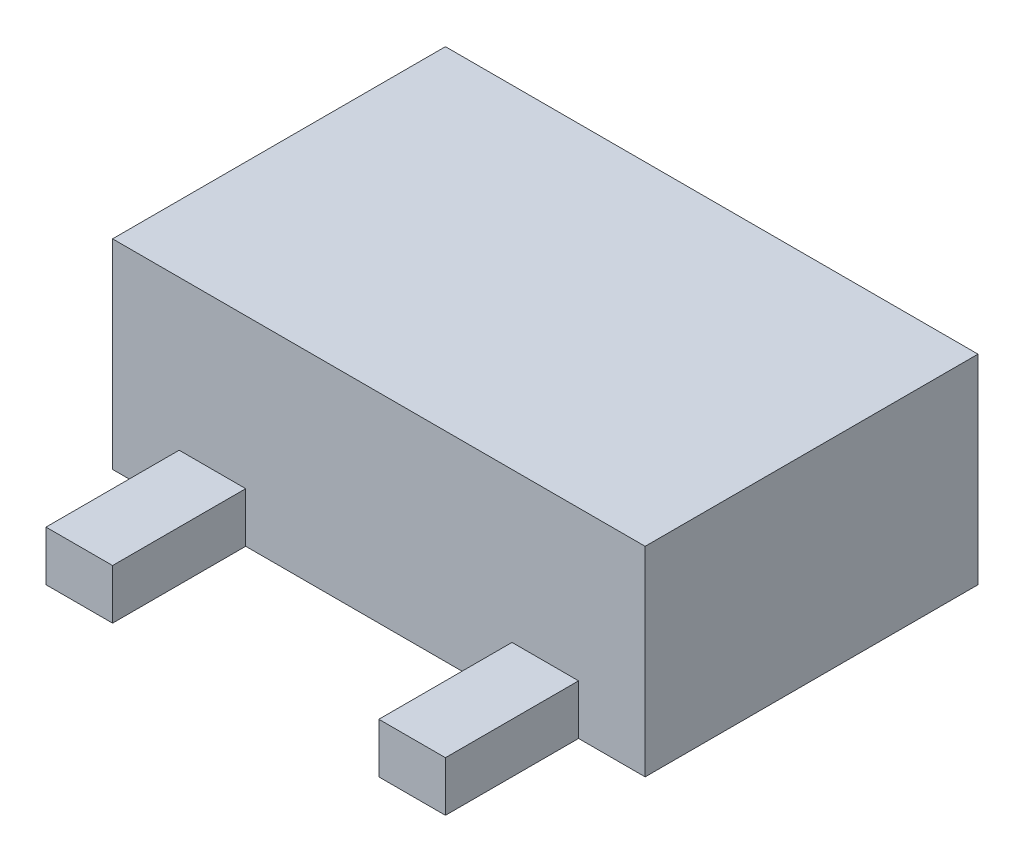
ISO-10303-21;
HEADER;
FILE_DESCRIPTION(('STEP AP214'),'2;1');
FILE_NAME('part.step','',(''),(''),'','','');
FILE_SCHEMA(('AUTOMOTIVE_DESIGN { 1 0 10303 214 1 1 1 1 }'));
ENDSEC;
DATA;
#1=APPLICATION_CONTEXT('core data for automotive mechanical design processes');
#2=APPLICATION_PROTOCOL_DEFINITION('international standard','automotive_design',2000,#1);
#3=PRODUCT_CONTEXT('',#1,'mechanical');
#4=PRODUCT('Part','Part','',(#3));
#5=PRODUCT_RELATED_PRODUCT_CATEGORY('part','',(#4));
#6=PRODUCT_DEFINITION_FORMATION('','',#4);
#7=PRODUCT_DEFINITION_CONTEXT('part definition',#1,'design');
#8=PRODUCT_DEFINITION('design','',#6,#7);
#9=PRODUCT_DEFINITION_SHAPE('','',#8);
#10=(LENGTH_UNIT() NAMED_UNIT(*) SI_UNIT(.MILLI.,.METRE.));
#11=(NAMED_UNIT(*) PLANE_ANGLE_UNIT() SI_UNIT($,.RADIAN.));
#12=(NAMED_UNIT(*) SI_UNIT($,.STERADIAN.) SOLID_ANGLE_UNIT());
#13=UNCERTAINTY_MEASURE_WITH_UNIT(LENGTH_MEASURE(1.E-05),#10,'distance_accuracy_value','');
#14=(GEOMETRIC_REPRESENTATION_CONTEXT(3) GLOBAL_UNCERTAINTY_ASSIGNED_CONTEXT((#13)) GLOBAL_UNIT_ASSIGNED_CONTEXT((#10,
#11,#12)) REPRESENTATION_CONTEXT('',''));
#15=CARTESIAN_POINT('',(0.,0.,0.));
#16=DIRECTION('',(0.,0.,1.));
#17=DIRECTION('',(1.,0.,0.));
#18=AXIS2_PLACEMENT_3D('',#15,#16,#17);
#19=CARTESIAN_POINT('',(-0.8,0.6,0.5));
#20=DIRECTION('',(0.,0.,-1.));
#21=DIRECTION('',(-1.,0.,0.));
#22=AXIS2_PLACEMENT_3D('',#19,#20,#21);
#23=PLANE('',#22);
#24=DIRECTION('',(-1.,0.,0.));
#25=VECTOR('',#24,1.);
#26=CARTESIAN_POINT('',(0.6,0.15,0.5));
#27=LINE('',#26,#25);
#28=CARTESIAN_POINT('',(0.6,0.15,0.5));
#29=VERTEX_POINT('',#28);
#30=CARTESIAN_POINT('',(0.4,0.15,0.5));
#31=VERTEX_POINT('',#30);
#32=EDGE_CURVE('E54',#29,#31,#27,.T.);
#33=ORIENTED_EDGE('',*,*,#32,.F.);
#34=DIRECTION('',(0.,-1.,0.));
#35=VECTOR('',#34,1.);
#36=CARTESIAN_POINT('',(0.6,0.597213595499958,0.5));
#37=LINE('',#36,#35);
#38=CARTESIAN_POINT('',(0.6,0.,0.5));
#39=VERTEX_POINT('',#38);
#40=EDGE_CURVE('E162',#29,#39,#37,.T.);
#41=ORIENTED_EDGE('',*,*,#40,.T.);
#42=DIRECTION('',(1.,0.,0.));
#43=VECTOR('',#42,1.);
#44=CARTESIAN_POINT('',(-0.8,0.,0.5));
#45=LINE('',#44,#43);
#46=CARTESIAN_POINT('',(0.8,0.,0.5));
#47=VERTEX_POINT('',#46);
#48=EDGE_CURVE('E147',#39,#47,#45,.T.);
#49=ORIENTED_EDGE('',*,*,#48,.T.);
#50=DIRECTION('',(0.,-1.,0.));
#51=VECTOR('',#50,1.);
#52=CARTESIAN_POINT('',(0.8,0.6,0.5));
#53=LINE('',#52,#51);
#54=CARTESIAN_POINT('',(0.8,0.6,0.5));
#55=VERTEX_POINT('',#54);
#56=EDGE_CURVE('E249',#55,#47,#53,.T.);
#57=ORIENTED_EDGE('',*,*,#56,.F.);
#58=DIRECTION('',(1.,0.,0.));
#59=VECTOR('',#58,1.);
#60=CARTESIAN_POINT('',(-0.8,0.6,0.5));
#61=LINE('',#60,#59);
#62=CARTESIAN_POINT('',(-0.8,0.6,0.5));
#63=VERTEX_POINT('',#62);
#64=EDGE_CURVE('E247',#63,#55,#61,.T.);
#65=ORIENTED_EDGE('',*,*,#64,.F.);
#66=DIRECTION('',(0.,-1.,0.));
#67=VECTOR('',#66,1.);
#68=CARTESIAN_POINT('',(-0.8,0.6,0.5));
#69=LINE('',#68,#67);
#70=CARTESIAN_POINT('',(-0.8,0.,0.5));
#71=VERTEX_POINT('',#70);
#72=EDGE_CURVE('E258',#63,#71,#69,.T.);
#73=ORIENTED_EDGE('',*,*,#72,.T.);
#74=CARTESIAN_POINT('',(-0.6,0.,0.5));
#75=VERTEX_POINT('',#74);
#76=EDGE_CURVE('E160',#71,#75,#45,.T.);
#77=ORIENTED_EDGE('',*,*,#76,.T.);
#78=DIRECTION('',(0.,-1.,0.));
#79=VECTOR('',#78,1.);
#80=CARTESIAN_POINT('',(-0.6,0.597213595499958,0.5));
#81=LINE('',#80,#79);
#82=CARTESIAN_POINT('',(-0.6,0.15,0.5));
#83=VERTEX_POINT('',#82);
#84=EDGE_CURVE('E205',#83,#75,#81,.T.);
#85=ORIENTED_EDGE('',*,*,#84,.F.);
#86=DIRECTION('',(1.,0.,0.));
#87=VECTOR('',#86,1.);
#88=CARTESIAN_POINT('',(-0.6,0.15,0.5));
#89=LINE('',#88,#87);
#90=CARTESIAN_POINT('',(-0.4,0.15,0.5));
#91=VERTEX_POINT('',#90);
#92=EDGE_CURVE('E191',#83,#91,#89,.T.);
#93=ORIENTED_EDGE('',*,*,#92,.T.);
#94=DIRECTION('',(0.,-1.,0.));
#95=VECTOR('',#94,1.);
#96=CARTESIAN_POINT('',(-0.4,0.597213595499958,0.5));
#97=LINE('',#96,#95);
#98=CARTESIAN_POINT('',(-0.4,0.,0.5));
#99=VERTEX_POINT('',#98);
#100=EDGE_CURVE('E207',#91,#99,#97,.T.);
#101=ORIENTED_EDGE('',*,*,#100,.T.);
#102=CARTESIAN_POINT('',(0.4,0.,0.5));
#103=VERTEX_POINT('',#102);
#104=EDGE_CURVE('E157',#99,#103,#45,.T.);
#105=ORIENTED_EDGE('',*,*,#104,.T.);
#106=DIRECTION('',(0.,-1.,0.));
#107=VECTOR('',#106,1.);
#108=CARTESIAN_POINT('',(0.4,0.597213595499958,0.5));
#109=LINE('',#108,#107);
#110=EDGE_CURVE('E50',#31,#103,#109,.T.);
#111=ORIENTED_EDGE('',*,*,#110,.F.);
#112=EDGE_LOOP('',(#33,#41,#49,#57,#65,#73,#77,#85,#93,#101,#105,#111));
#113=FACE_BOUND('',#112,.T.);
#114=ADVANCED_FACE('F35',(#113),#23,.F.);
#115=CARTESIAN_POINT('',(-0.8,0.6,-0.5));
#116=DIRECTION('',(0.,0.,1.));
#117=DIRECTION('',(1.,0.,0.));
#118=AXIS2_PLACEMENT_3D('',#115,#116,#117);
#119=PLANE('',#118);
#120=DIRECTION('',(0.,-1.,0.));
#121=VECTOR('',#120,1.);
#122=CARTESIAN_POINT('',(0.1,0.15,-0.500000000000001));
#123=LINE('',#122,#121);
#124=CARTESIAN_POINT('',(0.1,0.15,-0.500000000000001));
#125=VERTEX_POINT('',#124);
#126=CARTESIAN_POINT('',(0.1,0.,-0.500000000000001));
#127=VERTEX_POINT('',#126);
#128=EDGE_CURVE('E235',#125,#127,#123,.T.);
#129=ORIENTED_EDGE('',*,*,#128,.F.);
#130=DIRECTION('',(1.,0.,0.));
#131=VECTOR('',#130,1.);
#132=CARTESIAN_POINT('',(-0.1,0.15,-0.500000000000001));
#133=LINE('',#132,#131);
#134=CARTESIAN_POINT('',(-0.1,0.15,-0.500000000000001));
#135=VERTEX_POINT('',#134);
#136=EDGE_CURVE('E218',#135,#125,#133,.T.);
#137=ORIENTED_EDGE('',*,*,#136,.F.);
#138=DIRECTION('',(0.,-1.,0.));
#139=VECTOR('',#138,1.);
#140=CARTESIAN_POINT('',(-0.1,0.15,-0.500000000000001));
#141=LINE('',#140,#139);
#142=CARTESIAN_POINT('',(-0.1,0.,-0.5));
#143=VERTEX_POINT('',#142);
#144=EDGE_CURVE('E237',#135,#143,#141,.T.);
#145=ORIENTED_EDGE('',*,*,#144,.T.);
#146=DIRECTION('',(-1.,0.,0.));
#147=VECTOR('',#146,1.);
#148=CARTESIAN_POINT('',(-0.8,0.,-0.5));
#149=LINE('',#148,#147);
#150=CARTESIAN_POINT('',(-0.8,0.,-0.5));
#151=VERTEX_POINT('',#150);
#152=EDGE_CURVE('E251',#143,#151,#149,.T.);
#153=ORIENTED_EDGE('',*,*,#152,.T.);
#154=DIRECTION('',(0.,-1.,0.));
#155=VECTOR('',#154,1.);
#156=CARTESIAN_POINT('',(-0.8,0.6,-0.5));
#157=LINE('',#156,#155);
#158=CARTESIAN_POINT('',(-0.8,0.6,-0.5));
#159=VERTEX_POINT('',#158);
#160=EDGE_CURVE('E43',#159,#151,#157,.T.);
#161=ORIENTED_EDGE('',*,*,#160,.F.);
#162=DIRECTION('',(-1.,0.,0.));
#163=VECTOR('',#162,1.);
#164=CARTESIAN_POINT('',(-0.8,0.6,-0.5));
#165=LINE('',#164,#163);
#166=CARTESIAN_POINT('',(0.8,0.6,-0.5));
#167=VERTEX_POINT('',#166);
#168=EDGE_CURVE('E243',#167,#159,#165,.T.);
#169=ORIENTED_EDGE('',*,*,#168,.F.);
#170=DIRECTION('',(0.,-1.,0.));
#171=VECTOR('',#170,1.);
#172=CARTESIAN_POINT('',(0.8,0.6,-0.5));
#173=LINE('',#172,#171);
#174=CARTESIAN_POINT('',(0.8,0.,-0.5));
#175=VERTEX_POINT('',#174);
#176=EDGE_CURVE('E11',#167,#175,#173,.T.);
#177=ORIENTED_EDGE('',*,*,#176,.T.);
#178=EDGE_CURVE('E252',#175,#127,#149,.T.);
#179=ORIENTED_EDGE('',*,*,#178,.T.);
#180=EDGE_LOOP('',(#129,#137,#145,#153,#161,#169,#177,#179));
#181=FACE_BOUND('',#180,.T.);
#182=ADVANCED_FACE('F280',(#181),#119,.F.);
#183=CARTESIAN_POINT('',(0.8,0.6,-0.5));
#184=DIRECTION('',(-1.,0.,0.));
#185=DIRECTION('',(0.,0.,1.));
#186=AXIS2_PLACEMENT_3D('',#183,#184,#185);
#187=PLANE('',#186);
#188=DIRECTION('',(0.,0.,-1.));
#189=VECTOR('',#188,1.);
#190=CARTESIAN_POINT('',(0.8,0.,-0.5));
#191=LINE('',#190,#189);
#192=EDGE_CURVE('E154',#47,#175,#191,.T.);
#193=ORIENTED_EDGE('',*,*,#192,.T.);
#194=ORIENTED_EDGE('',*,*,#176,.F.);
#195=DIRECTION('',(0.,0.,-1.));
#196=VECTOR('',#195,1.);
#197=CARTESIAN_POINT('',(0.8,0.6,-0.5));
#198=LINE('',#197,#196);
#199=EDGE_CURVE('E240',#55,#167,#198,.T.);
#200=ORIENTED_EDGE('',*,*,#199,.F.);
#201=ORIENTED_EDGE('',*,*,#56,.T.);
#202=EDGE_LOOP('',(#193,#194,#200,#201));
#203=FACE_BOUND('',#202,.T.);
#204=ADVANCED_FACE('F37',(#203),#187,.F.);
#205=CARTESIAN_POINT('',(-0.8,0.6,-0.5));
#206=DIRECTION('',(1.,0.,0.));
#207=DIRECTION('',(0.,0.,-1.));
#208=AXIS2_PLACEMENT_3D('',#205,#206,#207);
#209=PLANE('',#208);
#210=DIRECTION('',(0.,0.,1.));
#211=VECTOR('',#210,1.);
#212=CARTESIAN_POINT('',(-0.8,0.,-0.5));
#213=LINE('',#212,#211);
#214=EDGE_CURVE('E158',#151,#71,#213,.T.);
#215=ORIENTED_EDGE('',*,*,#214,.T.);
#216=ORIENTED_EDGE('',*,*,#72,.F.);
#217=DIRECTION('',(0.,0.,1.));
#218=VECTOR('',#217,1.);
#219=CARTESIAN_POINT('',(-0.8,0.6,-0.5));
#220=LINE('',#219,#218);
#221=EDGE_CURVE('E245',#159,#63,#220,.T.);
#222=ORIENTED_EDGE('',*,*,#221,.F.);
#223=ORIENTED_EDGE('',*,*,#160,.T.);
#224=EDGE_LOOP('',(#215,#216,#222,#223));
#225=FACE_BOUND('',#224,.T.);
#226=ADVANCED_FACE('F265',(#225),#209,.F.);
#227=CARTESIAN_POINT('',(0.,0.6,0.));
#228=DIRECTION('',(0.,1.,0.));
#229=DIRECTION('',(0.,0.,1.));
#230=AXIS2_PLACEMENT_3D('',#227,#228,#229);
#231=PLANE('',#230);
#232=ORIENTED_EDGE('',*,*,#199,.T.);
#233=ORIENTED_EDGE('',*,*,#168,.T.);
#234=ORIENTED_EDGE('',*,*,#221,.T.);
#235=ORIENTED_EDGE('',*,*,#64,.T.);
#236=EDGE_LOOP('',(#232,#233,#234,#235));
#237=FACE_BOUND('',#236,.T.);
#238=ADVANCED_FACE('F277',(#237),#231,.T.);
#239=CARTESIAN_POINT('',(0.,0.,0.));
#240=DIRECTION('',(0.,1.,0.));
#241=DIRECTION('',(0.,0.,1.));
#242=AXIS2_PLACEMENT_3D('',#239,#240,#241);
#243=PLANE('',#242);
#244=ORIENTED_EDGE('',*,*,#192,.F.);
#245=ORIENTED_EDGE('',*,*,#48,.F.);
#246=DIRECTION('',(0.,0.,1.));
#247=VECTOR('',#246,1.);
#248=CARTESIAN_POINT('',(0.6,0.,0.5));
#249=LINE('',#248,#247);
#250=CARTESIAN_POINT('',(0.6,0.,0.9));
#251=VERTEX_POINT('',#250);
#252=EDGE_CURVE('E151',#39,#251,#249,.T.);
#253=ORIENTED_EDGE('',*,*,#252,.T.);
#254=DIRECTION('',(-1.,0.,0.));
#255=VECTOR('',#254,1.);
#256=CARTESIAN_POINT('',(0.6,0.,0.9));
#257=LINE('',#256,#255);
#258=CARTESIAN_POINT('',(0.4,0.,0.9));
#259=VERTEX_POINT('',#258);
#260=EDGE_CURVE('E173',#251,#259,#257,.T.);
#261=ORIENTED_EDGE('',*,*,#260,.T.);
#262=DIRECTION('',(0.,0.,-1.));
#263=VECTOR('',#262,1.);
#264=CARTESIAN_POINT('',(0.4,0.,0.5));
#265=LINE('',#264,#263);
#266=EDGE_CURVE('E170',#259,#103,#265,.T.);
#267=ORIENTED_EDGE('',*,*,#266,.T.);
#268=ORIENTED_EDGE('',*,*,#104,.F.);
#269=DIRECTION('',(0.,0.,-1.));
#270=VECTOR('',#269,1.);
#271=CARTESIAN_POINT('',(-0.4,0.,0.5));
#272=LINE('',#271,#270);
#273=CARTESIAN_POINT('',(-0.4,0.,0.9));
#274=VERTEX_POINT('',#273);
#275=EDGE_CURVE('E203',#274,#99,#272,.T.);
#276=ORIENTED_EDGE('',*,*,#275,.F.);
#277=DIRECTION('',(1.,0.,0.));
#278=VECTOR('',#277,1.);
#279=CARTESIAN_POINT('',(-0.6,0.,0.9));
#280=LINE('',#279,#278);
#281=CARTESIAN_POINT('',(-0.6,0.,0.9));
#282=VERTEX_POINT('',#281);
#283=EDGE_CURVE('E200',#282,#274,#280,.T.);
#284=ORIENTED_EDGE('',*,*,#283,.F.);
#285=DIRECTION('',(0.,0.,1.));
#286=VECTOR('',#285,1.);
#287=CARTESIAN_POINT('',(-0.6,0.,0.5));
#288=LINE('',#287,#286);
#289=EDGE_CURVE('E186',#75,#282,#288,.T.);
#290=ORIENTED_EDGE('',*,*,#289,.F.);
#291=ORIENTED_EDGE('',*,*,#76,.F.);
#292=ORIENTED_EDGE('',*,*,#214,.F.);
#293=ORIENTED_EDGE('',*,*,#152,.F.);
#294=DIRECTION('',(0.,0.,1.));
#295=VECTOR('',#294,1.);
#296=CARTESIAN_POINT('',(-0.1,0.,-0.500000000000001));
#297=LINE('',#296,#295);
#298=CARTESIAN_POINT('',(-0.1,0.,-0.900000000000001));
#299=VERTEX_POINT('',#298);
#300=EDGE_CURVE('E197',#299,#143,#297,.T.);
#301=ORIENTED_EDGE('',*,*,#300,.F.);
#302=DIRECTION('',(-1.,0.,0.));
#303=VECTOR('',#302,1.);
#304=CARTESIAN_POINT('',(-0.1,0.,-0.900000000000001));
#305=LINE('',#304,#303);
#306=CARTESIAN_POINT('',(0.1,0.,-0.9));
#307=VERTEX_POINT('',#306);
#308=EDGE_CURVE('E219',#307,#299,#305,.T.);
#309=ORIENTED_EDGE('',*,*,#308,.F.);
#310=DIRECTION('',(0.,0.,-1.));
#311=VECTOR('',#310,1.);
#312=CARTESIAN_POINT('',(0.1,0.,-0.500000000000001));
#313=LINE('',#312,#311);
#314=EDGE_CURVE('E227',#127,#307,#313,.T.);
#315=ORIENTED_EDGE('',*,*,#314,.F.);
#316=ORIENTED_EDGE('',*,*,#178,.F.);
#317=EDGE_LOOP('',(#244,#245,#253,#261,#267,#268,#276,#284,#290,#291,#292,#293,#301,#309,#315,#316));
#318=FACE_BOUND('',#317,.T.);
#319=ADVANCED_FACE('F148',(#318),#243,.F.);
#320=CARTESIAN_POINT('',(-0.1,0.15,-0.500000000000001));
#321=DIRECTION('',(1.,0.,0.));
#322=DIRECTION('',(0.,0.,-1.));
#323=AXIS2_PLACEMENT_3D('',#320,#321,#322);
#324=PLANE('',#323);
#325=ORIENTED_EDGE('',*,*,#300,.T.);
#326=ORIENTED_EDGE('',*,*,#144,.F.);
#327=DIRECTION('',(0.,0.,1.));
#328=VECTOR('',#327,1.);
#329=CARTESIAN_POINT('',(-0.1,0.15,-0.500000000000001));
#330=LINE('',#329,#328);
#331=CARTESIAN_POINT('',(-0.1,0.15,-0.900000000000001));
#332=VERTEX_POINT('',#331);
#333=EDGE_CURVE('E216',#332,#135,#330,.T.);
#334=ORIENTED_EDGE('',*,*,#333,.F.);
#335=DIRECTION('',(0.,-1.,0.));
#336=VECTOR('',#335,1.);
#337=CARTESIAN_POINT('',(-0.1,0.15,-0.900000000000001));
#338=LINE('',#337,#336);
#339=EDGE_CURVE('E225',#332,#299,#338,.T.);
#340=ORIENTED_EDGE('',*,*,#339,.T.);
#341=EDGE_LOOP('',(#325,#326,#334,#340));
#342=FACE_BOUND('',#341,.T.);
#343=ADVANCED_FACE('F295',(#342),#324,.F.);
#344=CARTESIAN_POINT('',(0.1,0.15,-0.500000000000001));
#345=DIRECTION('',(-1.,0.,0.));
#346=DIRECTION('',(0.,0.,1.));
#347=AXIS2_PLACEMENT_3D('',#344,#345,#346);
#348=PLANE('',#347);
#349=ORIENTED_EDGE('',*,*,#314,.T.);
#350=DIRECTION('',(0.,-1.,0.));
#351=VECTOR('',#350,1.);
#352=CARTESIAN_POINT('',(0.1,0.15,-0.9));
#353=LINE('',#352,#351);
#354=CARTESIAN_POINT('',(0.1,0.15,-0.9));
#355=VERTEX_POINT('',#354);
#356=EDGE_CURVE('E232',#355,#307,#353,.T.);
#357=ORIENTED_EDGE('',*,*,#356,.F.);
#358=DIRECTION('',(0.,0.,-1.));
#359=VECTOR('',#358,1.);
#360=CARTESIAN_POINT('',(0.1,0.15,-0.500000000000001));
#361=LINE('',#360,#359);
#362=EDGE_CURVE('E221',#125,#355,#361,.T.);
#363=ORIENTED_EDGE('',*,*,#362,.F.);
#364=ORIENTED_EDGE('',*,*,#128,.T.);
#365=EDGE_LOOP('',(#349,#357,#363,#364));
#366=FACE_BOUND('',#365,.T.);
#367=ADVANCED_FACE('F300',(#366),#348,.F.);
#368=CARTESIAN_POINT('',(-0.1,0.15,-0.900000000000001));
#369=DIRECTION('',(0.,0.,1.));
#370=DIRECTION('',(1.,0.,0.));
#371=AXIS2_PLACEMENT_3D('',#368,#369,#370);
#372=PLANE('',#371);
#373=ORIENTED_EDGE('',*,*,#308,.T.);
#374=ORIENTED_EDGE('',*,*,#339,.F.);
#375=DIRECTION('',(-1.,0.,0.));
#376=VECTOR('',#375,1.);
#377=CARTESIAN_POINT('',(-0.1,0.15,-0.900000000000001));
#378=LINE('',#377,#376);
#379=EDGE_CURVE('E223',#355,#332,#378,.T.);
#380=ORIENTED_EDGE('',*,*,#379,.F.);
#381=ORIENTED_EDGE('',*,*,#356,.T.);
#382=EDGE_LOOP('',(#373,#374,#380,#381));
#383=FACE_BOUND('',#382,.T.);
#384=ADVANCED_FACE('F304',(#383),#372,.F.);
#385=CARTESIAN_POINT('',(0.,0.15,0.));
#386=DIRECTION('',(0.,-1.,0.));
#387=DIRECTION('',(0.,0.,-1.));
#388=AXIS2_PLACEMENT_3D('',#385,#386,#387);
#389=PLANE('',#388);
#390=ORIENTED_EDGE('',*,*,#333,.T.);
#391=ORIENTED_EDGE('',*,*,#136,.T.);
#392=ORIENTED_EDGE('',*,*,#362,.T.);
#393=ORIENTED_EDGE('',*,*,#379,.T.);
#394=EDGE_LOOP('',(#390,#391,#392,#393));
#395=FACE_BOUND('',#394,.T.);
#396=ADVANCED_FACE('F308',(#395),#389,.F.);
#397=CARTESIAN_POINT('',(-0.4,0.597213595499958,0.5));
#398=DIRECTION('',(-1.,0.,0.));
#399=DIRECTION('',(0.,0.,1.));
#400=AXIS2_PLACEMENT_3D('',#397,#398,#399);
#401=PLANE('',#400);
#402=ORIENTED_EDGE('',*,*,#100,.F.);
#403=DIRECTION('',(0.,0.,1.));
#404=VECTOR('',#403,1.);
#405=CARTESIAN_POINT('',(-0.4,0.15,0.5));
#406=LINE('',#405,#404);
#407=CARTESIAN_POINT('',(-0.4,0.15,0.9));
#408=VERTEX_POINT('',#407);
#409=EDGE_CURVE('E187',#91,#408,#406,.T.);
#410=ORIENTED_EDGE('',*,*,#409,.T.);
#411=DIRECTION('',(0.,-1.,0.));
#412=VECTOR('',#411,1.);
#413=CARTESIAN_POINT('',(-0.4,0.597213595499958,0.9));
#414=LINE('',#413,#412);
#415=EDGE_CURVE('E210',#408,#274,#414,.T.);
#416=ORIENTED_EDGE('',*,*,#415,.T.);
#417=ORIENTED_EDGE('',*,*,#275,.T.);
#418=EDGE_LOOP('',(#402,#410,#416,#417));
#419=FACE_BOUND('',#418,.T.);
#420=ADVANCED_FACE('F312',(#419),#401,.F.);
#421=CARTESIAN_POINT('',(-0.6,0.597213595499958,0.9));
#422=DIRECTION('',(0.,0.,-1.));
#423=DIRECTION('',(-1.,0.,0.));
#424=AXIS2_PLACEMENT_3D('',#421,#422,#423);
#425=PLANE('',#424);
#426=ORIENTED_EDGE('',*,*,#415,.F.);
#427=DIRECTION('',(-1.,0.,0.));
#428=VECTOR('',#427,1.);
#429=CARTESIAN_POINT('',(-0.6,0.15,0.9));
#430=LINE('',#429,#428);
#431=CARTESIAN_POINT('',(-0.6,0.15,0.9));
#432=VERTEX_POINT('',#431);
#433=EDGE_CURVE('E190',#408,#432,#430,.T.);
#434=ORIENTED_EDGE('',*,*,#433,.T.);
#435=DIRECTION('',(0.,-1.,0.));
#436=VECTOR('',#435,1.);
#437=CARTESIAN_POINT('',(-0.6,0.597213595499958,0.9));
#438=LINE('',#437,#436);
#439=EDGE_CURVE('E212',#432,#282,#438,.T.);
#440=ORIENTED_EDGE('',*,*,#439,.T.);
#441=ORIENTED_EDGE('',*,*,#283,.T.);
#442=EDGE_LOOP('',(#426,#434,#440,#441));
#443=FACE_BOUND('',#442,.T.);
#444=ADVANCED_FACE('F318',(#443),#425,.F.);
#445=CARTESIAN_POINT('',(-0.6,0.597213595499958,0.5));
#446=DIRECTION('',(1.,0.,0.));
#447=DIRECTION('',(0.,0.,-1.));
#448=AXIS2_PLACEMENT_3D('',#445,#446,#447);
#449=PLANE('',#448);
#450=ORIENTED_EDGE('',*,*,#439,.F.);
#451=DIRECTION('',(0.,0.,-1.));
#452=VECTOR('',#451,1.);
#453=CARTESIAN_POINT('',(-0.6,0.15,0.5));
#454=LINE('',#453,#452);
#455=EDGE_CURVE('E194',#432,#83,#454,.T.);
#456=ORIENTED_EDGE('',*,*,#455,.T.);
#457=ORIENTED_EDGE('',*,*,#84,.T.);
#458=ORIENTED_EDGE('',*,*,#289,.T.);
#459=EDGE_LOOP('',(#450,#456,#457,#458));
#460=FACE_BOUND('',#459,.T.);
#461=ADVANCED_FACE('F314',(#460),#449,.F.);
#462=CARTESIAN_POINT('',(0.,0.15,0.));
#463=DIRECTION('',(0.,-1.,0.));
#464=DIRECTION('',(0.,0.,-1.));
#465=AXIS2_PLACEMENT_3D('',#462,#463,#464);
#466=PLANE('',#465);
#467=ORIENTED_EDGE('',*,*,#433,.F.);
#468=ORIENTED_EDGE('',*,*,#409,.F.);
#469=ORIENTED_EDGE('',*,*,#92,.F.);
#470=ORIENTED_EDGE('',*,*,#455,.F.);
#471=EDGE_LOOP('',(#467,#468,#469,#470));
#472=FACE_BOUND('',#471,.T.);
#473=ADVANCED_FACE('F317',(#472),#466,.F.);
#474=CARTESIAN_POINT('',(0.6,0.597213595499958,0.5));
#475=DIRECTION('',(1.,0.,0.));
#476=DIRECTION('',(0.,0.,-1.));
#477=AXIS2_PLACEMENT_3D('',#474,#475,#476);
#478=PLANE('',#477);
#479=DIRECTION('',(0.,0.,-1.));
#480=VECTOR('',#479,1.);
#481=CARTESIAN_POINT('',(0.6,0.15,0.5));
#482=LINE('',#481,#480);
#483=CARTESIAN_POINT('',(0.6,0.15,0.9));
#484=VERTEX_POINT('',#483);
#485=EDGE_CURVE('E176',#484,#29,#482,.T.);
#486=ORIENTED_EDGE('',*,*,#485,.F.);
#487=DIRECTION('',(0.,-1.,0.));
#488=VECTOR('',#487,1.);
#489=CARTESIAN_POINT('',(0.6,0.597213595499958,0.9));
#490=LINE('',#489,#488);
#491=EDGE_CURVE('E169',#484,#251,#490,.T.);
#492=ORIENTED_EDGE('',*,*,#491,.T.);
#493=ORIENTED_EDGE('',*,*,#252,.F.);
#494=ORIENTED_EDGE('',*,*,#40,.F.);
#495=EDGE_LOOP('',(#486,#492,#493,#494));
#496=FACE_BOUND('',#495,.T.);
#497=ADVANCED_FACE('F167',(#496),#478,.T.);
#498=CARTESIAN_POINT('',(0.4,0.597213595499958,0.5));
#499=DIRECTION('',(-1.,0.,0.));
#500=DIRECTION('',(0.,0.,1.));
#501=AXIS2_PLACEMENT_3D('',#498,#499,#500);
#502=PLANE('',#501);
#503=DIRECTION('',(0.,0.,1.));
#504=VECTOR('',#503,1.);
#505=CARTESIAN_POINT('',(0.4,0.15,0.5));
#506=LINE('',#505,#504);
#507=CARTESIAN_POINT('',(0.4,0.15,0.9));
#508=VERTEX_POINT('',#507);
#509=EDGE_CURVE('E165',#31,#508,#506,.T.);
#510=ORIENTED_EDGE('',*,*,#509,.F.);
#511=ORIENTED_EDGE('',*,*,#110,.T.);
#512=ORIENTED_EDGE('',*,*,#266,.F.);
#513=DIRECTION('',(0.,-1.,0.));
#514=VECTOR('',#513,1.);
#515=CARTESIAN_POINT('',(0.4,0.597213595499958,0.9));
#516=LINE('',#515,#514);
#517=EDGE_CURVE('E181',#508,#259,#516,.T.);
#518=ORIENTED_EDGE('',*,*,#517,.F.);
#519=EDGE_LOOP('',(#510,#511,#512,#518));
#520=FACE_BOUND('',#519,.T.);
#521=ADVANCED_FACE('F331',(#520),#502,.T.);
#522=CARTESIAN_POINT('',(0.6,0.597213595499958,0.9));
#523=DIRECTION('',(0.,0.,1.));
#524=DIRECTION('',(1.,0.,0.));
#525=AXIS2_PLACEMENT_3D('',#522,#523,#524);
#526=PLANE('',#525);
#527=DIRECTION('',(1.,0.,0.));
#528=VECTOR('',#527,1.);
#529=CARTESIAN_POINT('',(0.6,0.15,0.9));
#530=LINE('',#529,#528);
#531=EDGE_CURVE('E184',#508,#484,#530,.T.);
#532=ORIENTED_EDGE('',*,*,#531,.F.);
#533=ORIENTED_EDGE('',*,*,#517,.T.);
#534=ORIENTED_EDGE('',*,*,#260,.F.);
#535=ORIENTED_EDGE('',*,*,#491,.F.);
#536=EDGE_LOOP('',(#532,#533,#534,#535));
#537=FACE_BOUND('',#536,.T.);
#538=ADVANCED_FACE('F334',(#537),#526,.T.);
#539=CARTESIAN_POINT('',(0.,0.15,0.));
#540=DIRECTION('',(0.,-1.,0.));
#541=DIRECTION('',(0.,0.,-1.));
#542=AXIS2_PLACEMENT_3D('',#539,#540,#541);
#543=PLANE('',#542);
#544=ORIENTED_EDGE('',*,*,#485,.T.);
#545=ORIENTED_EDGE('',*,*,#32,.T.);
#546=ORIENTED_EDGE('',*,*,#509,.T.);
#547=ORIENTED_EDGE('',*,*,#531,.T.);
#548=EDGE_LOOP('',(#544,#545,#546,#547));
#549=FACE_BOUND('',#548,.T.);
#550=ADVANCED_FACE('F338',(#549),#543,.F.);
#551=CLOSED_SHELL('',(#114,#182,#204,#226,#238,#319,#343,#367,#384,#396,#420,#444,#461,#473,
#497,#521,#538,#550));
#552=MANIFOLD_SOLID_BREP('B2',#551);
#553=ADVANCED_BREP_SHAPE_REPRESENTATION('',(#18,#552),#14);
#554=SHAPE_DEFINITION_REPRESENTATION(#9,#553);
ENDSEC;
END-ISO-10303-21;
